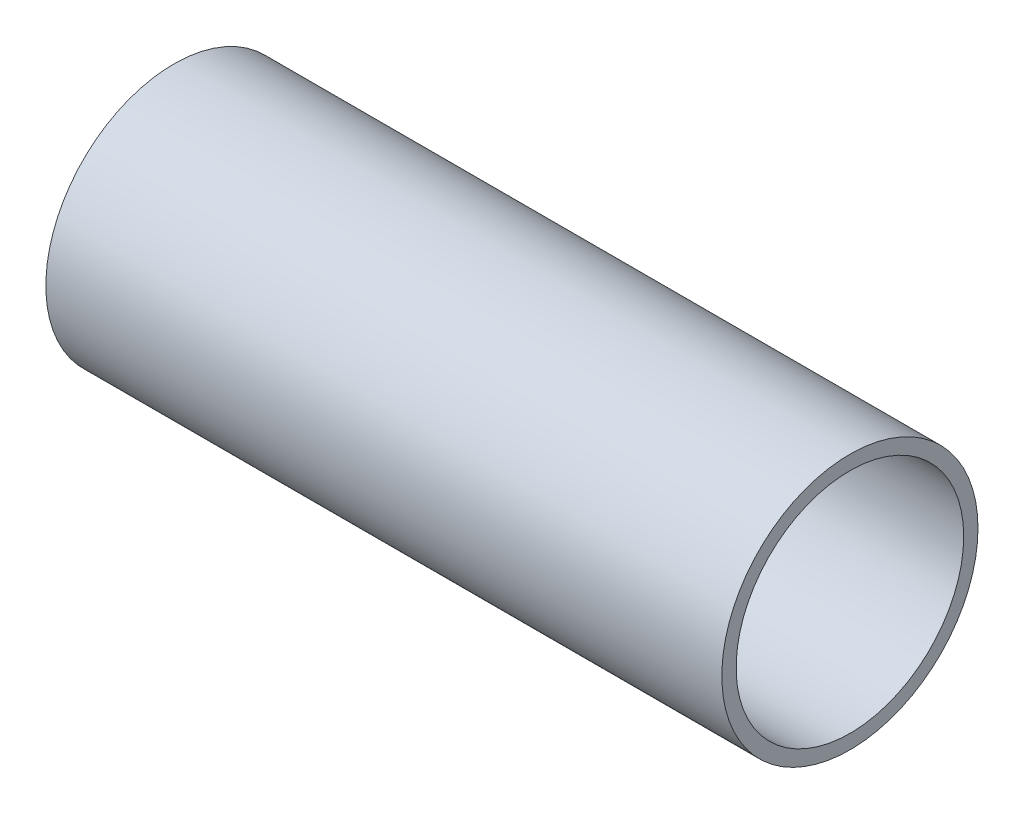
ISO-10303-21;
HEADER;
FILE_DESCRIPTION(('STEP AP214'),'2;1');
FILE_NAME('part.step','',(''),(''),'','','');
FILE_SCHEMA(('AUTOMOTIVE_DESIGN { 1 0 10303 214 1 1 1 1 }'));
ENDSEC;
DATA;
#1=APPLICATION_CONTEXT('core data for automotive mechanical design processes');
#2=APPLICATION_PROTOCOL_DEFINITION('international standard','automotive_design',2000,#1);
#3=PRODUCT_CONTEXT('',#1,'mechanical');
#4=PRODUCT('Part','Part','',(#3));
#5=PRODUCT_RELATED_PRODUCT_CATEGORY('part','',(#4));
#6=PRODUCT_DEFINITION_FORMATION('','',#4);
#7=PRODUCT_DEFINITION_CONTEXT('part definition',#1,'design');
#8=PRODUCT_DEFINITION('design','',#6,#7);
#9=PRODUCT_DEFINITION_SHAPE('','',#8);
#10=(LENGTH_UNIT() NAMED_UNIT(*) SI_UNIT(.MILLI.,.METRE.));
#11=(NAMED_UNIT(*) PLANE_ANGLE_UNIT() SI_UNIT($,.RADIAN.));
#12=(NAMED_UNIT(*) SI_UNIT($,.STERADIAN.) SOLID_ANGLE_UNIT());
#13=UNCERTAINTY_MEASURE_WITH_UNIT(LENGTH_MEASURE(1.E-05),#10,'distance_accuracy_value','');
#14=(GEOMETRIC_REPRESENTATION_CONTEXT(3) GLOBAL_UNCERTAINTY_ASSIGNED_CONTEXT((#13)) GLOBAL_UNIT_ASSIGNED_CONTEXT((#10,
#11,#12)) REPRESENTATION_CONTEXT('',''));
#15=CARTESIAN_POINT('',(0.,0.,0.));
#16=DIRECTION('',(0.,0.,1.));
#17=DIRECTION('',(1.,0.,0.));
#18=AXIS2_PLACEMENT_3D('',#15,#16,#17);
#19=CARTESIAN_POINT('',(301.625,0.,0.));
#20=DIRECTION('',(1.,0.,0.));
#21=DIRECTION('',(0.,0.,-1.));
#22=AXIS2_PLACEMENT_3D('',#19,#20,#21);
#23=PLANE('',#22);
#24=CARTESIAN_POINT('',(301.625,0.,0.));
#25=DIRECTION('',(1.,0.,0.));
#26=DIRECTION('',(0.,0.,-1.));
#27=AXIS2_PLACEMENT_3D('',#24,#25,#26);
#28=CIRCLE('',#27,57.15);
#29=CARTESIAN_POINT('',(301.625,0.,-57.15));
#30=VERTEX_POINT('',#29);
#31=EDGE_CURVE('E10',#30,#30,#28,.T.);
#32=ORIENTED_EDGE('',*,*,#31,.T.);
#33=EDGE_LOOP('',(#32));
#34=FACE_BOUND('',#33,.T.);
#35=CARTESIAN_POINT('',(301.625,0.,0.));
#36=DIRECTION('',(1.,0.,0.));
#37=DIRECTION('',(0.,0.,-1.));
#38=AXIS2_PLACEMENT_3D('',#35,#36,#37);
#39=CIRCLE('',#38,50.7746);
#40=CARTESIAN_POINT('',(301.625,0.,-50.7746));
#41=VERTEX_POINT('',#40);
#42=EDGE_CURVE('E53',#41,#41,#39,.T.);
#43=ORIENTED_EDGE('',*,*,#42,.F.);
#44=EDGE_LOOP('',(#43));
#45=FACE_BOUND('',#44,.T.);
#46=ADVANCED_FACE('F39',(#34,#45),#23,.T.);
#47=CARTESIAN_POINT('',(0.,0.,0.));
#48=DIRECTION('',(1.,0.,0.));
#49=DIRECTION('',(0.,0.,-1.));
#50=AXIS2_PLACEMENT_3D('',#47,#48,#49);
#51=PLANE('',#50);
#52=CARTESIAN_POINT('',(0.,0.,0.));
#53=DIRECTION('',(1.,0.,0.));
#54=DIRECTION('',(0.,0.,-1.));
#55=AXIS2_PLACEMENT_3D('',#52,#53,#54);
#56=CIRCLE('',#55,57.15);
#57=CARTESIAN_POINT('',(0.,0.,-57.15));
#58=VERTEX_POINT('',#57);
#59=EDGE_CURVE('E43',#58,#58,#56,.T.);
#60=ORIENTED_EDGE('',*,*,#59,.F.);
#61=EDGE_LOOP('',(#60));
#62=FACE_BOUND('',#61,.T.);
#63=CARTESIAN_POINT('',(0.,0.,0.));
#64=DIRECTION('',(1.,0.,0.));
#65=DIRECTION('',(0.,0.,-1.));
#66=AXIS2_PLACEMENT_3D('',#63,#64,#65);
#67=CIRCLE('',#66,50.7746);
#68=CARTESIAN_POINT('',(0.,0.,-50.7746));
#69=VERTEX_POINT('',#68);
#70=EDGE_CURVE('E55',#69,#69,#67,.T.);
#71=ORIENTED_EDGE('',*,*,#70,.T.);
#72=EDGE_LOOP('',(#71));
#73=FACE_BOUND('',#72,.T.);
#74=ADVANCED_FACE('F68',(#62,#73),#51,.F.);
#75=CARTESIAN_POINT('',(301.625,0.,0.));
#76=DIRECTION('',(-1.,0.,0.));
#77=DIRECTION('',(0.,0.,1.));
#78=AXIS2_PLACEMENT_3D('',#75,#76,#77);
#79=CYLINDRICAL_SURFACE('',#78,57.15);
#80=ORIENTED_EDGE('',*,*,#31,.F.);
#81=EDGE_LOOP('',(#80));
#82=FACE_BOUND('',#81,.T.);
#83=ORIENTED_EDGE('',*,*,#59,.T.);
#84=EDGE_LOOP('',(#83));
#85=FACE_BOUND('',#84,.T.);
#86=ADVANCED_FACE('F41',(#82,#85),#79,.T.);
#87=CARTESIAN_POINT('',(301.625,0.,0.));
#88=DIRECTION('',(-1.,0.,0.));
#89=DIRECTION('',(0.,0.,1.));
#90=AXIS2_PLACEMENT_3D('',#87,#88,#89);
#91=CYLINDRICAL_SURFACE('',#90,50.7746);
#92=ORIENTED_EDGE('',*,*,#42,.T.);
#93=EDGE_LOOP('',(#92));
#94=FACE_BOUND('',#93,.T.);
#95=ORIENTED_EDGE('',*,*,#70,.F.);
#96=EDGE_LOOP('',(#95));
#97=FACE_BOUND('',#96,.T.);
#98=ADVANCED_FACE('F64',(#94,#97),#91,.F.);
#99=CLOSED_SHELL('',(#46,#74,#86,#98));
#100=MANIFOLD_SOLID_BREP('B2',#99);
#101=ADVANCED_BREP_SHAPE_REPRESENTATION('',(#18,#100),#14);
#102=SHAPE_DEFINITION_REPRESENTATION(#9,#101);
ENDSEC;
END-ISO-10303-21;
